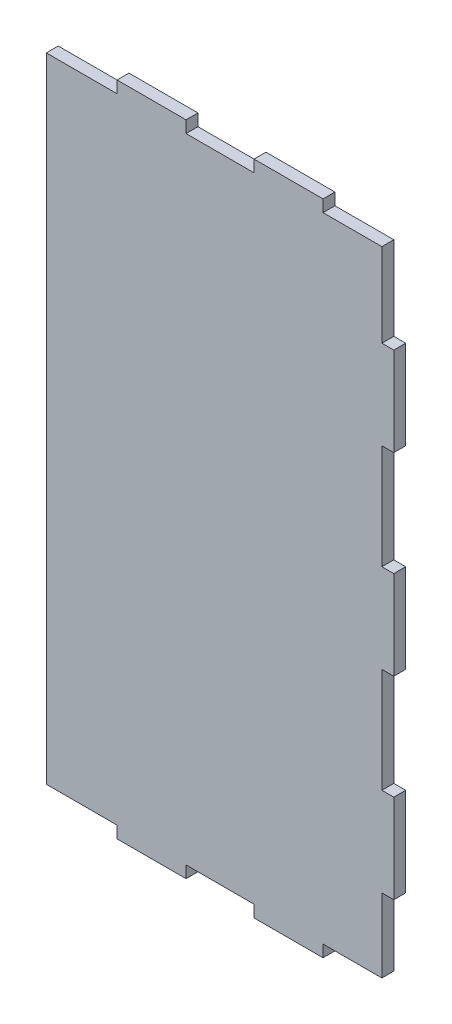
ISO-10303-21;
HEADER;
FILE_DESCRIPTION(('STEP AP214'),'2;1');
FILE_NAME('part.step','',(''),(''),'','','');
FILE_SCHEMA(('AUTOMOTIVE_DESIGN { 1 0 10303 214 1 1 1 1 }'));
ENDSEC;
DATA;
#1=APPLICATION_CONTEXT('core data for automotive mechanical design processes');
#2=APPLICATION_PROTOCOL_DEFINITION('international standard','automotive_design',2000,#1);
#3=PRODUCT_CONTEXT('',#1,'mechanical');
#4=PRODUCT('Part','Part','',(#3));
#5=PRODUCT_RELATED_PRODUCT_CATEGORY('part','',(#4));
#6=PRODUCT_DEFINITION_FORMATION('','',#4);
#7=PRODUCT_DEFINITION_CONTEXT('part definition',#1,'design');
#8=PRODUCT_DEFINITION('design','',#6,#7);
#9=PRODUCT_DEFINITION_SHAPE('','',#8);
#10=(LENGTH_UNIT() NAMED_UNIT(*) SI_UNIT(.MILLI.,.METRE.));
#11=(NAMED_UNIT(*) PLANE_ANGLE_UNIT() SI_UNIT($,.RADIAN.));
#12=(NAMED_UNIT(*) SI_UNIT($,.STERADIAN.) SOLID_ANGLE_UNIT());
#13=UNCERTAINTY_MEASURE_WITH_UNIT(LENGTH_MEASURE(1.E-05),#10,'distance_accuracy_value','');
#14=(GEOMETRIC_REPRESENTATION_CONTEXT(3) GLOBAL_UNCERTAINTY_ASSIGNED_CONTEXT((#13)) GLOBAL_UNIT_ASSIGNED_CONTEXT((#10,
#11,#12)) REPRESENTATION_CONTEXT('',''));
#15=CARTESIAN_POINT('',(0.,0.,0.));
#16=DIRECTION('',(0.,0.,1.));
#17=DIRECTION('',(1.,0.,0.));
#18=AXIS2_PLACEMENT_3D('',#15,#16,#17);
#19=CARTESIAN_POINT('',(350.,2.17082714312181E-13,12.));
#20=DIRECTION('',(-1.,0.,0.));
#21=DIRECTION('',(0.,-1.,0.));
#22=AXIS2_PLACEMENT_3D('',#19,#20,#21);
#23=PLANE('',#22);
#24=DIRECTION('',(0.,1.,0.));
#25=VECTOR('',#24,1.);
#26=CARTESIAN_POINT('',(350.,2.17082714312181E-13,0.));
#27=LINE('',#26,#25);
#28=CARTESIAN_POINT('',(350.,-380.75,0.));
#29=VERTEX_POINT('',#28);
#30=CARTESIAN_POINT('',(350.,-291.25,0.));
#31=VERTEX_POINT('',#30);
#32=EDGE_CURVE('E284',#29,#31,#27,.T.);
#33=ORIENTED_EDGE('',*,*,#32,.T.);
#34=DIRECTION('',(0.,0.,-1.));
#35=VECTOR('',#34,1.);
#36=CARTESIAN_POINT('',(350.,-291.25,12.));
#37=LINE('',#36,#35);
#38=CARTESIAN_POINT('',(350.,-291.25,12.));
#39=VERTEX_POINT('',#38);
#40=EDGE_CURVE('E11',#39,#31,#37,.T.);
#41=ORIENTED_EDGE('',*,*,#40,.F.);
#42=DIRECTION('',(0.,1.,0.));
#43=VECTOR('',#42,1.);
#44=CARTESIAN_POINT('',(350.,2.17082714312181E-13,12.));
#45=LINE('',#44,#43);
#46=CARTESIAN_POINT('',(350.,-380.75,12.));
#47=VERTEX_POINT('',#46);
#48=EDGE_CURVE('E166',#47,#39,#45,.T.);
#49=ORIENTED_EDGE('',*,*,#48,.F.);
#50=DIRECTION('',(0.,0.,-1.));
#51=VECTOR('',#50,1.);
#52=CARTESIAN_POINT('',(350.,-380.75,12.));
#53=LINE('',#52,#51);
#54=EDGE_CURVE('E280',#47,#29,#53,.T.);
#55=ORIENTED_EDGE('',*,*,#54,.T.);
#56=EDGE_LOOP('',(#33,#41,#49,#55));
#57=FACE_BOUND('',#56,.T.);
#58=ADVANCED_FACE('F41',(#57),#23,.F.);
#59=CARTESIAN_POINT('',(0.,-291.25,12.));
#60=DIRECTION('',(0.,1.,0.));
#61=DIRECTION('',(0.,0.,1.));
#62=AXIS2_PLACEMENT_3D('',#59,#60,#61);
#63=PLANE('',#62);
#64=DIRECTION('',(1.,0.,0.));
#65=VECTOR('',#64,1.);
#66=CARTESIAN_POINT('',(0.,-291.25,0.));
#67=LINE('',#66,#65);
#68=CARTESIAN_POINT('',(338.,-291.25,0.));
#69=VERTEX_POINT('',#68);
#70=EDGE_CURVE('E288',#69,#31,#67,.T.);
#71=ORIENTED_EDGE('',*,*,#70,.F.);
#72=DIRECTION('',(0.,0.,-1.));
#73=VECTOR('',#72,1.);
#74=CARTESIAN_POINT('',(338.,-291.25,12.));
#75=LINE('',#74,#73);
#76=CARTESIAN_POINT('',(338.,-291.25,12.));
#77=VERTEX_POINT('',#76);
#78=EDGE_CURVE('E50',#77,#69,#75,.T.);
#79=ORIENTED_EDGE('',*,*,#78,.F.);
#80=DIRECTION('',(1.,0.,0.));
#81=VECTOR('',#80,1.);
#82=CARTESIAN_POINT('',(0.,-291.25,12.));
#83=LINE('',#82,#81);
#84=EDGE_CURVE('E514',#77,#39,#83,.T.);
#85=ORIENTED_EDGE('',*,*,#84,.T.);
#86=ORIENTED_EDGE('',*,*,#40,.T.);
#87=EDGE_LOOP('',(#71,#79,#85,#86));
#88=FACE_BOUND('',#87,.T.);
#89=ADVANCED_FACE('F500',(#88),#63,.T.);
#90=CARTESIAN_POINT('',(338.,1.77846152759859E-13,12.));
#91=DIRECTION('',(1.,0.,0.));
#92=DIRECTION('',(0.,1.,0.));
#93=AXIS2_PLACEMENT_3D('',#90,#91,#92);
#94=PLANE('',#93);
#95=DIRECTION('',(0.,-1.,0.));
#96=VECTOR('',#95,1.);
#97=CARTESIAN_POINT('',(338.,1.77846152759859E-13,0.));
#98=LINE('',#97,#96);
#99=CARTESIAN_POINT('',(338.,-185.75,0.));
#100=VERTEX_POINT('',#99);
#101=EDGE_CURVE('E292',#100,#69,#98,.T.);
#102=ORIENTED_EDGE('',*,*,#101,.F.);
#103=DIRECTION('',(0.,0.,-1.));
#104=VECTOR('',#103,1.);
#105=CARTESIAN_POINT('',(338.,-185.75,12.));
#106=LINE('',#105,#104);
#107=CARTESIAN_POINT('',(338.,-185.75,12.));
#108=VERTEX_POINT('',#107);
#109=EDGE_CURVE('E488',#108,#100,#106,.T.);
#110=ORIENTED_EDGE('',*,*,#109,.F.);
#111=DIRECTION('',(0.,-1.,0.));
#112=VECTOR('',#111,1.);
#113=CARTESIAN_POINT('',(338.,1.77846152759859E-13,12.));
#114=LINE('',#113,#112);
#115=EDGE_CURVE('E497',#108,#77,#114,.T.);
#116=ORIENTED_EDGE('',*,*,#115,.T.);
#117=ORIENTED_EDGE('',*,*,#78,.T.);
#118=EDGE_LOOP('',(#102,#110,#116,#117));
#119=FACE_BOUND('',#118,.T.);
#120=ADVANCED_FACE('F495',(#119),#94,.T.);
#121=CARTESIAN_POINT('',(4.29633180883589E-13,-185.750000000001,12.));
#122=DIRECTION('',(0.,-1.,0.));
#123=DIRECTION('',(1.,0.,0.));
#124=AXIS2_PLACEMENT_3D('',#121,#122,#123);
#125=PLANE('',#124);
#126=DIRECTION('',(-1.,0.,0.));
#127=VECTOR('',#126,1.);
#128=CARTESIAN_POINT('',(4.29633180883589E-13,-185.750000000001,0.));
#129=LINE('',#128,#127);
#130=CARTESIAN_POINT('',(350.,-185.75,0.));
#131=VERTEX_POINT('',#130);
#132=EDGE_CURVE('E296',#131,#100,#129,.T.);
#133=ORIENTED_EDGE('',*,*,#132,.F.);
#134=DIRECTION('',(0.,0.,-1.));
#135=VECTOR('',#134,1.);
#136=CARTESIAN_POINT('',(350.,-185.75,12.));
#137=LINE('',#136,#135);
#138=CARTESIAN_POINT('',(350.,-185.75,12.));
#139=VERTEX_POINT('',#138);
#140=EDGE_CURVE('E485',#139,#131,#137,.T.);
#141=ORIENTED_EDGE('',*,*,#140,.F.);
#142=DIRECTION('',(-1.,0.,0.));
#143=VECTOR('',#142,1.);
#144=CARTESIAN_POINT('',(4.29633180883589E-13,-185.750000000001,12.));
#145=LINE('',#144,#143);
#146=EDGE_CURVE('E511',#139,#108,#145,.T.);
#147=ORIENTED_EDGE('',*,*,#146,.T.);
#148=ORIENTED_EDGE('',*,*,#109,.T.);
#149=EDGE_LOOP('',(#133,#141,#147,#148));
#150=FACE_BOUND('',#149,.T.);
#151=ADVANCED_FACE('F508',(#150),#125,.T.);
#152=CARTESIAN_POINT('',(350.,0.,12.));
#153=DIRECTION('',(1.,0.,0.));
#154=DIRECTION('',(0.,0.,-1.));
#155=AXIS2_PLACEMENT_3D('',#152,#153,#154);
#156=PLANE('',#155);
#157=DIRECTION('',(0.,-1.,0.));
#158=VECTOR('',#157,1.);
#159=CARTESIAN_POINT('',(350.,0.,0.));
#160=LINE('',#159,#158);
#161=CARTESIAN_POINT('',(350.,-96.25,0.));
#162=VERTEX_POINT('',#161);
#163=EDGE_CURVE('E300',#162,#131,#160,.T.);
#164=ORIENTED_EDGE('',*,*,#163,.F.);
#165=DIRECTION('',(0.,0.,-1.));
#166=VECTOR('',#165,1.);
#167=CARTESIAN_POINT('',(350.,-96.25,12.));
#168=LINE('',#167,#166);
#169=CARTESIAN_POINT('',(350.,-96.25,12.));
#170=VERTEX_POINT('',#169);
#171=EDGE_CURVE('E482',#170,#162,#168,.T.);
#172=ORIENTED_EDGE('',*,*,#171,.F.);
#173=DIRECTION('',(0.,-1.,0.));
#174=VECTOR('',#173,1.);
#175=CARTESIAN_POINT('',(350.,0.,12.));
#176=LINE('',#175,#174);
#177=EDGE_CURVE('E519',#170,#139,#176,.T.);
#178=ORIENTED_EDGE('',*,*,#177,.T.);
#179=ORIENTED_EDGE('',*,*,#140,.T.);
#180=EDGE_LOOP('',(#164,#172,#178,#179));
#181=FACE_BOUND('',#180,.T.);
#182=ADVANCED_FACE('F632',(#181),#156,.T.);
#183=CARTESIAN_POINT('',(0.,-96.25,12.));
#184=DIRECTION('',(0.,-1.,0.));
#185=DIRECTION('',(0.,0.,-1.));
#186=AXIS2_PLACEMENT_3D('',#183,#184,#185);
#187=PLANE('',#186);
#188=DIRECTION('',(-1.,0.,0.));
#189=VECTOR('',#188,1.);
#190=CARTESIAN_POINT('',(0.,-96.25,0.));
#191=LINE('',#190,#189);
#192=CARTESIAN_POINT('',(338.,-96.25,0.));
#193=VERTEX_POINT('',#192);
#194=EDGE_CURVE('E304',#162,#193,#191,.T.);
#195=ORIENTED_EDGE('',*,*,#194,.T.);
#196=DIRECTION('',(0.,0.,-1.));
#197=VECTOR('',#196,1.);
#198=CARTESIAN_POINT('',(338.,-96.25,12.));
#199=LINE('',#198,#197);
#200=CARTESIAN_POINT('',(338.,-96.25,12.));
#201=VERTEX_POINT('',#200);
#202=EDGE_CURVE('E478',#201,#193,#199,.T.);
#203=ORIENTED_EDGE('',*,*,#202,.F.);
#204=DIRECTION('',(-1.,0.,0.));
#205=VECTOR('',#204,1.);
#206=CARTESIAN_POINT('',(0.,-96.25,12.));
#207=LINE('',#206,#205);
#208=EDGE_CURVE('E526',#170,#201,#207,.T.);
#209=ORIENTED_EDGE('',*,*,#208,.F.);
#210=ORIENTED_EDGE('',*,*,#171,.T.);
#211=EDGE_LOOP('',(#195,#203,#209,#210));
#212=FACE_BOUND('',#211,.T.);
#213=ADVANCED_FACE('F635',(#212),#187,.F.);
#214=CARTESIAN_POINT('',(338.,-1.78162792794447E-12,12.));
#215=DIRECTION('',(-1.,0.,0.));
#216=DIRECTION('',(0.,-1.,0.));
#217=AXIS2_PLACEMENT_3D('',#214,#215,#216);
#218=PLANE('',#217);
#219=DIRECTION('',(0.,1.,0.));
#220=VECTOR('',#219,1.);
#221=CARTESIAN_POINT('',(338.,-1.78162792794447E-12,0.));
#222=LINE('',#221,#220);
#223=CARTESIAN_POINT('',(338.,-12.,0.));
#224=VERTEX_POINT('',#223);
#225=EDGE_CURVE('E307',#193,#224,#222,.T.);
#226=ORIENTED_EDGE('',*,*,#225,.T.);
#227=DIRECTION('',(0.,0.,-1.));
#228=VECTOR('',#227,1.);
#229=CARTESIAN_POINT('',(338.,-12.,12.));
#230=LINE('',#229,#228);
#231=CARTESIAN_POINT('',(338.,-12.,12.));
#232=VERTEX_POINT('',#231);
#233=EDGE_CURVE('E475',#232,#224,#230,.T.);
#234=ORIENTED_EDGE('',*,*,#233,.F.);
#235=DIRECTION('',(0.,1.,0.));
#236=VECTOR('',#235,1.);
#237=CARTESIAN_POINT('',(338.,-1.78162792794447E-12,12.));
#238=LINE('',#237,#236);
#239=EDGE_CURVE('E529',#201,#232,#238,.T.);
#240=ORIENTED_EDGE('',*,*,#239,.F.);
#241=ORIENTED_EDGE('',*,*,#202,.T.);
#242=EDGE_LOOP('',(#226,#234,#240,#241));
#243=FACE_BOUND('',#242,.T.);
#244=ADVANCED_FACE('F639',(#243),#218,.F.);
#245=CARTESIAN_POINT('',(0.,-12.,12.));
#246=DIRECTION('',(0.,1.,0.));
#247=DIRECTION('',(-1.,0.,0.));
#248=AXIS2_PLACEMENT_3D('',#245,#246,#247);
#249=PLANE('',#248);
#250=DIRECTION('',(1.,0.,0.));
#251=VECTOR('',#250,1.);
#252=CARTESIAN_POINT('',(0.,-12.,0.));
#253=LINE('',#252,#251);
#254=CARTESIAN_POINT('',(278.75,-12.,0.));
#255=VERTEX_POINT('',#254);
#256=EDGE_CURVE('E311',#255,#224,#253,.T.);
#257=ORIENTED_EDGE('',*,*,#256,.F.);
#258=DIRECTION('',(0.,0.,-1.));
#259=VECTOR('',#258,1.);
#260=CARTESIAN_POINT('',(278.75,-12.,12.));
#261=LINE('',#260,#259);
#262=CARTESIAN_POINT('',(278.75,-12.,12.));
#263=VERTEX_POINT('',#262);
#264=EDGE_CURVE('E472',#263,#255,#261,.T.);
#265=ORIENTED_EDGE('',*,*,#264,.F.);
#266=DIRECTION('',(1.,0.,0.));
#267=VECTOR('',#266,1.);
#268=CARTESIAN_POINT('',(0.,-12.,12.));
#269=LINE('',#268,#267);
#270=EDGE_CURVE('E532',#263,#232,#269,.T.);
#271=ORIENTED_EDGE('',*,*,#270,.T.);
#272=ORIENTED_EDGE('',*,*,#233,.T.);
#273=EDGE_LOOP('',(#257,#265,#271,#272));
#274=FACE_BOUND('',#273,.T.);
#275=ADVANCED_FACE('F643',(#274),#249,.T.);
#276=CARTESIAN_POINT('',(278.75,0.,12.));
#277=DIRECTION('',(1.,0.,0.));
#278=DIRECTION('',(0.,0.,-1.));
#279=AXIS2_PLACEMENT_3D('',#276,#277,#278);
#280=PLANE('',#279);
#281=DIRECTION('',(0.,-1.,0.));
#282=VECTOR('',#281,1.);
#283=CARTESIAN_POINT('',(278.75,0.,0.));
#284=LINE('',#283,#282);
#285=CARTESIAN_POINT('',(278.75,-4.45287292250738E-13,0.));
#286=VERTEX_POINT('',#285);
#287=EDGE_CURVE('E315',#286,#255,#284,.T.);
#288=ORIENTED_EDGE('',*,*,#287,.F.);
#289=DIRECTION('',(0.,0.,-1.));
#290=VECTOR('',#289,1.);
#291=CARTESIAN_POINT('',(278.75,-4.45287292250738E-13,12.));
#292=LINE('',#291,#290);
#293=CARTESIAN_POINT('',(278.75,-4.45287292250738E-13,12.));
#294=VERTEX_POINT('',#293);
#295=EDGE_CURVE('E469',#294,#286,#292,.T.);
#296=ORIENTED_EDGE('',*,*,#295,.F.);
#297=DIRECTION('',(0.,-1.,0.));
#298=VECTOR('',#297,1.);
#299=CARTESIAN_POINT('',(278.75,0.,12.));
#300=LINE('',#299,#298);
#301=EDGE_CURVE('E536',#294,#263,#300,.T.);
#302=ORIENTED_EDGE('',*,*,#301,.T.);
#303=ORIENTED_EDGE('',*,*,#264,.T.);
#304=EDGE_LOOP('',(#288,#296,#302,#303));
#305=FACE_BOUND('',#304,.T.);
#306=ADVANCED_FACE('F647',(#305),#280,.T.);
#307=CARTESIAN_POINT('',(0.,0.,12.));
#308=DIRECTION('',(0.,1.,0.));
#309=DIRECTION('',(-1.,0.,0.));
#310=AXIS2_PLACEMENT_3D('',#307,#308,#309);
#311=PLANE('',#310);
#312=DIRECTION('',(1.,0.,0.));
#313=VECTOR('',#312,1.);
#314=CARTESIAN_POINT('',(0.,0.,0.));
#315=LINE('',#314,#313);
#316=CARTESIAN_POINT('',(209.25,-3.34264989788222E-13,0.));
#317=VERTEX_POINT('',#316);
#318=EDGE_CURVE('E319',#317,#286,#315,.T.);
#319=ORIENTED_EDGE('',*,*,#318,.F.);
#320=DIRECTION('',(0.,0.,-1.));
#321=VECTOR('',#320,1.);
#322=CARTESIAN_POINT('',(209.25,-3.34264989788222E-13,12.));
#323=LINE('',#322,#321);
#324=CARTESIAN_POINT('',(209.25,-3.34264989788222E-13,12.));
#325=VERTEX_POINT('',#324);
#326=EDGE_CURVE('E466',#325,#317,#323,.T.);
#327=ORIENTED_EDGE('',*,*,#326,.F.);
#328=DIRECTION('',(1.,0.,0.));
#329=VECTOR('',#328,1.);
#330=CARTESIAN_POINT('',(0.,0.,12.));
#331=LINE('',#330,#329);
#332=EDGE_CURVE('E540',#325,#294,#331,.T.);
#333=ORIENTED_EDGE('',*,*,#332,.T.);
#334=ORIENTED_EDGE('',*,*,#295,.T.);
#335=EDGE_LOOP('',(#319,#327,#333,#334));
#336=FACE_BOUND('',#335,.T.);
#337=ADVANCED_FACE('F651',(#336),#311,.T.);
#338=CARTESIAN_POINT('',(209.25,0.,12.));
#339=DIRECTION('',(1.,0.,0.));
#340=DIRECTION('',(0.,0.,-1.));
#341=AXIS2_PLACEMENT_3D('',#338,#339,#340);
#342=PLANE('',#341);
#343=DIRECTION('',(0.,-1.,0.));
#344=VECTOR('',#343,1.);
#345=CARTESIAN_POINT('',(209.25,0.,0.));
#346=LINE('',#345,#344);
#347=CARTESIAN_POINT('',(209.25,-11.9999999999999,0.));
#348=VERTEX_POINT('',#347);
#349=EDGE_CURVE('E323',#317,#348,#346,.T.);
#350=ORIENTED_EDGE('',*,*,#349,.T.);
#351=DIRECTION('',(0.,0.,-1.));
#352=VECTOR('',#351,1.);
#353=CARTESIAN_POINT('',(209.25,-11.9999999999999,12.));
#354=LINE('',#353,#352);
#355=CARTESIAN_POINT('',(209.25,-11.9999999999999,12.));
#356=VERTEX_POINT('',#355);
#357=EDGE_CURVE('E463',#356,#348,#354,.T.);
#358=ORIENTED_EDGE('',*,*,#357,.F.);
#359=DIRECTION('',(0.,-1.,0.));
#360=VECTOR('',#359,1.);
#361=CARTESIAN_POINT('',(209.25,0.,12.));
#362=LINE('',#361,#360);
#363=EDGE_CURVE('E544',#325,#356,#362,.T.);
#364=ORIENTED_EDGE('',*,*,#363,.F.);
#365=ORIENTED_EDGE('',*,*,#326,.T.);
#366=EDGE_LOOP('',(#350,#358,#364,#365));
#367=FACE_BOUND('',#366,.T.);
#368=ADVANCED_FACE('F655',(#367),#342,.F.);
#369=CARTESIAN_POINT('',(0.,-11.9999999999999,12.));
#370=DIRECTION('',(0.,1.,0.));
#371=DIRECTION('',(0.,0.,1.));
#372=AXIS2_PLACEMENT_3D('',#369,#370,#371);
#373=PLANE('',#372);
#374=DIRECTION('',(1.,0.,0.));
#375=VECTOR('',#374,1.);
#376=CARTESIAN_POINT('',(0.,-11.9999999999999,0.));
#377=LINE('',#376,#375);
#378=CARTESIAN_POINT('',(140.75,-11.9999999999999,0.));
#379=VERTEX_POINT('',#378);
#380=EDGE_CURVE('E327',#379,#348,#377,.T.);
#381=ORIENTED_EDGE('',*,*,#380,.F.);
#382=DIRECTION('',(0.,0.,-1.));
#383=VECTOR('',#382,1.);
#384=CARTESIAN_POINT('',(140.75,-11.9999999999999,12.));
#385=LINE('',#384,#383);
#386=CARTESIAN_POINT('',(140.75,-11.9999999999999,12.));
#387=VERTEX_POINT('',#386);
#388=EDGE_CURVE('E460',#387,#379,#385,.T.);
#389=ORIENTED_EDGE('',*,*,#388,.F.);
#390=DIRECTION('',(1.,0.,0.));
#391=VECTOR('',#390,1.);
#392=CARTESIAN_POINT('',(0.,-11.9999999999999,12.));
#393=LINE('',#392,#391);
#394=EDGE_CURVE('E547',#387,#356,#393,.T.);
#395=ORIENTED_EDGE('',*,*,#394,.T.);
#396=ORIENTED_EDGE('',*,*,#357,.T.);
#397=EDGE_LOOP('',(#381,#389,#395,#396));
#398=FACE_BOUND('',#397,.T.);
#399=ADVANCED_FACE('F659',(#398),#373,.T.);
#400=CARTESIAN_POINT('',(140.75,0.,12.));
#401=DIRECTION('',(1.,0.,0.));
#402=DIRECTION('',(0.,0.,-1.));
#403=AXIS2_PLACEMENT_3D('',#400,#401,#402);
#404=PLANE('',#403);
#405=DIRECTION('',(0.,-1.,0.));
#406=VECTOR('',#405,1.);
#407=CARTESIAN_POINT('',(140.75,0.,0.));
#408=LINE('',#407,#406);
#409=CARTESIAN_POINT('',(140.75,2.24840130526605E-13,0.));
#410=VERTEX_POINT('',#409);
#411=EDGE_CURVE('E331',#410,#379,#408,.T.);
#412=ORIENTED_EDGE('',*,*,#411,.F.);
#413=DIRECTION('',(0.,0.,-1.));
#414=VECTOR('',#413,1.);
#415=CARTESIAN_POINT('',(140.75,2.24840130526605E-13,12.));
#416=LINE('',#415,#414);
#417=CARTESIAN_POINT('',(140.75,2.24840130526605E-13,12.));
#418=VERTEX_POINT('',#417);
#419=EDGE_CURVE('E457',#418,#410,#416,.T.);
#420=ORIENTED_EDGE('',*,*,#419,.F.);
#421=DIRECTION('',(0.,-1.,0.));
#422=VECTOR('',#421,1.);
#423=CARTESIAN_POINT('',(140.75,0.,12.));
#424=LINE('',#423,#422);
#425=EDGE_CURVE('E551',#418,#387,#424,.T.);
#426=ORIENTED_EDGE('',*,*,#425,.T.);
#427=ORIENTED_EDGE('',*,*,#388,.T.);
#428=EDGE_LOOP('',(#412,#420,#426,#427));
#429=FACE_BOUND('',#428,.T.);
#430=ADVANCED_FACE('F663',(#429),#404,.T.);
#431=CARTESIAN_POINT('',(0.,0.,12.));
#432=DIRECTION('',(0.,1.,0.));
#433=DIRECTION('',(-1.,0.,0.));
#434=AXIS2_PLACEMENT_3D('',#431,#432,#433);
#435=PLANE('',#434);
#436=DIRECTION('',(1.,0.,0.));
#437=VECTOR('',#436,1.);
#438=CARTESIAN_POINT('',(0.,0.,0.));
#439=LINE('',#438,#437);
#440=CARTESIAN_POINT('',(71.25,1.1381782806409E-13,0.));
#441=VERTEX_POINT('',#440);
#442=EDGE_CURVE('E335',#441,#410,#439,.T.);
#443=ORIENTED_EDGE('',*,*,#442,.F.);
#444=DIRECTION('',(0.,0.,-1.));
#445=VECTOR('',#444,1.);
#446=CARTESIAN_POINT('',(71.25,1.1381782806409E-13,12.));
#447=LINE('',#446,#445);
#448=CARTESIAN_POINT('',(71.25,1.1381782806409E-13,12.));
#449=VERTEX_POINT('',#448);
#450=EDGE_CURVE('E454',#449,#441,#447,.T.);
#451=ORIENTED_EDGE('',*,*,#450,.F.);
#452=DIRECTION('',(1.,0.,0.));
#453=VECTOR('',#452,1.);
#454=CARTESIAN_POINT('',(0.,0.,12.));
#455=LINE('',#454,#453);
#456=EDGE_CURVE('E555',#449,#418,#455,.T.);
#457=ORIENTED_EDGE('',*,*,#456,.T.);
#458=ORIENTED_EDGE('',*,*,#419,.T.);
#459=EDGE_LOOP('',(#443,#451,#457,#458));
#460=FACE_BOUND('',#459,.T.);
#461=ADVANCED_FACE('F667',(#460),#435,.T.);
#462=CARTESIAN_POINT('',(71.25,0.,12.));
#463=DIRECTION('',(1.,0.,0.));
#464=DIRECTION('',(0.,0.,-1.));
#465=AXIS2_PLACEMENT_3D('',#462,#463,#464);
#466=PLANE('',#465);
#467=DIRECTION('',(0.,-1.,0.));
#468=VECTOR('',#467,1.);
#469=CARTESIAN_POINT('',(71.25,0.,0.));
#470=LINE('',#469,#468);
#471=CARTESIAN_POINT('',(71.25,-12.,0.));
#472=VERTEX_POINT('',#471);
#473=EDGE_CURVE('E339',#441,#472,#470,.T.);
#474=ORIENTED_EDGE('',*,*,#473,.T.);
#475=DIRECTION('',(0.,0.,-1.));
#476=VECTOR('',#475,1.);
#477=CARTESIAN_POINT('',(71.25,-12.,12.));
#478=LINE('',#477,#476);
#479=CARTESIAN_POINT('',(71.25,-12.,12.));
#480=VERTEX_POINT('',#479);
#481=EDGE_CURVE('E450',#480,#472,#478,.T.);
#482=ORIENTED_EDGE('',*,*,#481,.F.);
#483=DIRECTION('',(0.,-1.,0.));
#484=VECTOR('',#483,1.);
#485=CARTESIAN_POINT('',(71.25,0.,12.));
#486=LINE('',#485,#484);
#487=EDGE_CURVE('E559',#449,#480,#486,.T.);
#488=ORIENTED_EDGE('',*,*,#487,.F.);
#489=ORIENTED_EDGE('',*,*,#450,.T.);
#490=EDGE_LOOP('',(#474,#482,#488,#489));
#491=FACE_BOUND('',#490,.T.);
#492=ADVANCED_FACE('F671',(#491),#466,.F.);
#493=CARTESIAN_POINT('',(0.,-12.,12.));
#494=DIRECTION('',(0.,-1.,0.));
#495=DIRECTION('',(0.,0.,-1.));
#496=AXIS2_PLACEMENT_3D('',#493,#494,#495);
#497=PLANE('',#496);
#498=DIRECTION('',(-1.,0.,0.));
#499=VECTOR('',#498,1.);
#500=CARTESIAN_POINT('',(0.,-12.,0.));
#501=LINE('',#500,#499);
#502=CARTESIAN_POINT('',(0.,-12.,0.));
#503=VERTEX_POINT('',#502);
#504=EDGE_CURVE('E342',#472,#503,#501,.T.);
#505=ORIENTED_EDGE('',*,*,#504,.T.);
#506=DIRECTION('',(0.,0.,-1.));
#507=VECTOR('',#506,1.);
#508=CARTESIAN_POINT('',(0.,-12.,12.));
#509=LINE('',#508,#507);
#510=CARTESIAN_POINT('',(0.,-12.,12.));
#511=VERTEX_POINT('',#510);
#512=EDGE_CURVE('E446',#511,#503,#509,.T.);
#513=ORIENTED_EDGE('',*,*,#512,.F.);
#514=DIRECTION('',(-1.,0.,0.));
#515=VECTOR('',#514,1.);
#516=CARTESIAN_POINT('',(0.,-12.,12.));
#517=LINE('',#516,#515);
#518=EDGE_CURVE('E562',#480,#511,#517,.T.);
#519=ORIENTED_EDGE('',*,*,#518,.F.);
#520=ORIENTED_EDGE('',*,*,#481,.T.);
#521=EDGE_LOOP('',(#505,#513,#519,#520));
#522=FACE_BOUND('',#521,.T.);
#523=ADVANCED_FACE('F675',(#522),#497,.F.);
#524=CARTESIAN_POINT('',(0.,0.,12.));
#525=DIRECTION('',(1.,0.,0.));
#526=DIRECTION('',(0.,0.,-1.));
#527=AXIS2_PLACEMENT_3D('',#524,#525,#526);
#528=PLANE('',#527);
#529=DIRECTION('',(0.,-1.,0.));
#530=VECTOR('',#529,1.);
#531=CARTESIAN_POINT('',(0.,0.,0.));
#532=LINE('',#531,#530);
#533=CARTESIAN_POINT('',(0.,-650.,0.));
#534=VERTEX_POINT('',#533);
#535=EDGE_CURVE('E345',#503,#534,#532,.T.);
#536=ORIENTED_EDGE('',*,*,#535,.T.);
#537=DIRECTION('',(0.,0.,-1.));
#538=VECTOR('',#537,1.);
#539=CARTESIAN_POINT('',(0.,-650.,12.));
#540=LINE('',#539,#538);
#541=CARTESIAN_POINT('',(0.,-650.,12.));
#542=VERTEX_POINT('',#541);
#543=EDGE_CURVE('E443',#542,#534,#540,.T.);
#544=ORIENTED_EDGE('',*,*,#543,.F.);
#545=DIRECTION('',(0.,-1.,0.));
#546=VECTOR('',#545,1.);
#547=CARTESIAN_POINT('',(0.,0.,12.));
#548=LINE('',#547,#546);
#549=EDGE_CURVE('E565',#511,#542,#548,.T.);
#550=ORIENTED_EDGE('',*,*,#549,.F.);
#551=ORIENTED_EDGE('',*,*,#512,.T.);
#552=EDGE_LOOP('',(#536,#544,#550,#551));
#553=FACE_BOUND('',#552,.T.);
#554=ADVANCED_FACE('F679',(#553),#528,.F.);
#555=CARTESIAN_POINT('',(0.,-650.,12.));
#556=DIRECTION('',(0.,-1.,0.));
#557=DIRECTION('',(0.,0.,-1.));
#558=AXIS2_PLACEMENT_3D('',#555,#556,#557);
#559=PLANE('',#558);
#560=DIRECTION('',(-1.,0.,0.));
#561=VECTOR('',#560,1.);
#562=CARTESIAN_POINT('',(0.,-650.,0.));
#563=LINE('',#562,#561);
#564=CARTESIAN_POINT('',(71.25,-650.,0.));
#565=VERTEX_POINT('',#564);
#566=EDGE_CURVE('E349',#565,#534,#563,.T.);
#567=ORIENTED_EDGE('',*,*,#566,.F.);
#568=DIRECTION('',(0.,0.,-1.));
#569=VECTOR('',#568,1.);
#570=CARTESIAN_POINT('',(71.25,-650.,12.));
#571=LINE('',#570,#569);
#572=CARTESIAN_POINT('',(71.25,-650.,12.));
#573=VERTEX_POINT('',#572);
#574=EDGE_CURVE('E440',#573,#565,#571,.T.);
#575=ORIENTED_EDGE('',*,*,#574,.F.);
#576=DIRECTION('',(-1.,0.,0.));
#577=VECTOR('',#576,1.);
#578=CARTESIAN_POINT('',(0.,-650.,12.));
#579=LINE('',#578,#577);
#580=EDGE_CURVE('E568',#573,#542,#579,.T.);
#581=ORIENTED_EDGE('',*,*,#580,.T.);
#582=ORIENTED_EDGE('',*,*,#543,.T.);
#583=EDGE_LOOP('',(#567,#575,#581,#582));
#584=FACE_BOUND('',#583,.T.);
#585=ADVANCED_FACE('F683',(#584),#559,.T.);
#586=CARTESIAN_POINT('',(71.25,0.,12.));
#587=DIRECTION('',(-1.,0.,0.));
#588=DIRECTION('',(0.,0.,1.));
#589=AXIS2_PLACEMENT_3D('',#586,#587,#588);
#590=PLANE('',#589);
#591=DIRECTION('',(0.,1.,0.));
#592=VECTOR('',#591,1.);
#593=CARTESIAN_POINT('',(71.25,0.,0.));
#594=LINE('',#593,#592);
#595=CARTESIAN_POINT('',(71.25,-662.,0.));
#596=VERTEX_POINT('',#595);
#597=EDGE_CURVE('E353',#596,#565,#594,.T.);
#598=ORIENTED_EDGE('',*,*,#597,.F.);
#599=DIRECTION('',(0.,0.,-1.));
#600=VECTOR('',#599,1.);
#601=CARTESIAN_POINT('',(71.25,-662.,12.));
#602=LINE('',#601,#600);
#603=CARTESIAN_POINT('',(71.25,-662.,12.));
#604=VERTEX_POINT('',#603);
#605=EDGE_CURVE('E437',#604,#596,#602,.T.);
#606=ORIENTED_EDGE('',*,*,#605,.F.);
#607=DIRECTION('',(0.,1.,0.));
#608=VECTOR('',#607,1.);
#609=CARTESIAN_POINT('',(71.25,0.,12.));
#610=LINE('',#609,#608);
#611=EDGE_CURVE('E572',#604,#573,#610,.T.);
#612=ORIENTED_EDGE('',*,*,#611,.T.);
#613=ORIENTED_EDGE('',*,*,#574,.T.);
#614=EDGE_LOOP('',(#598,#606,#612,#613));
#615=FACE_BOUND('',#614,.T.);
#616=ADVANCED_FACE('F687',(#615),#590,.T.);
#617=CARTESIAN_POINT('',(0.,-662.,12.));
#618=DIRECTION('',(0.,1.,0.));
#619=DIRECTION('',(0.,0.,1.));
#620=AXIS2_PLACEMENT_3D('',#617,#618,#619);
#621=PLANE('',#620);
#622=DIRECTION('',(1.,0.,0.));
#623=VECTOR('',#622,1.);
#624=CARTESIAN_POINT('',(0.,-662.,0.));
#625=LINE('',#624,#623);
#626=CARTESIAN_POINT('',(140.75,-662.,0.));
#627=VERTEX_POINT('',#626);
#628=EDGE_CURVE('E357',#596,#627,#625,.T.);
#629=ORIENTED_EDGE('',*,*,#628,.T.);
#630=DIRECTION('',(0.,0.,-1.));
#631=VECTOR('',#630,1.);
#632=CARTESIAN_POINT('',(140.75,-662.,12.));
#633=LINE('',#632,#631);
#634=CARTESIAN_POINT('',(140.75,-662.,12.));
#635=VERTEX_POINT('',#634);
#636=EDGE_CURVE('E433',#635,#627,#633,.T.);
#637=ORIENTED_EDGE('',*,*,#636,.F.);
#638=DIRECTION('',(1.,0.,0.));
#639=VECTOR('',#638,1.);
#640=CARTESIAN_POINT('',(0.,-662.,12.));
#641=LINE('',#640,#639);
#642=EDGE_CURVE('E576',#604,#635,#641,.T.);
#643=ORIENTED_EDGE('',*,*,#642,.F.);
#644=ORIENTED_EDGE('',*,*,#605,.T.);
#645=EDGE_LOOP('',(#629,#637,#643,#644));
#646=FACE_BOUND('',#645,.T.);
#647=ADVANCED_FACE('F691',(#646),#621,.F.);
#648=CARTESIAN_POINT('',(140.750000000005,-9.76649316974974E-13,12.));
#649=DIRECTION('',(-1.,0.,0.));
#650=DIRECTION('',(0.,-1.,0.));
#651=AXIS2_PLACEMENT_3D('',#648,#649,#650);
#652=PLANE('',#651);
#653=DIRECTION('',(0.,1.,0.));
#654=VECTOR('',#653,1.);
#655=CARTESIAN_POINT('',(140.750000000005,-9.76649316974974E-13,0.));
#656=LINE('',#655,#654);
#657=CARTESIAN_POINT('',(140.75,-650.,0.));
#658=VERTEX_POINT('',#657);
#659=EDGE_CURVE('E360',#627,#658,#656,.T.);
#660=ORIENTED_EDGE('',*,*,#659,.T.);
#661=DIRECTION('',(0.,0.,-1.));
#662=VECTOR('',#661,1.);
#663=CARTESIAN_POINT('',(140.75,-650.,12.));
#664=LINE('',#663,#662);
#665=CARTESIAN_POINT('',(140.75,-650.,12.));
#666=VERTEX_POINT('',#665);
#667=EDGE_CURVE('E429',#666,#658,#664,.T.);
#668=ORIENTED_EDGE('',*,*,#667,.F.);
#669=DIRECTION('',(0.,1.,0.));
#670=VECTOR('',#669,1.);
#671=CARTESIAN_POINT('',(140.750000000005,-9.76649316974974E-13,12.));
#672=LINE('',#671,#670);
#673=EDGE_CURVE('E579',#635,#666,#672,.T.);
#674=ORIENTED_EDGE('',*,*,#673,.F.);
#675=ORIENTED_EDGE('',*,*,#636,.T.);
#676=EDGE_LOOP('',(#660,#668,#674,#675));
#677=FACE_BOUND('',#676,.T.);
#678=ADVANCED_FACE('F695',(#677),#652,.F.);
#679=CARTESIAN_POINT('',(0.,-650.,12.));
#680=DIRECTION('',(0.,1.,0.));
#681=DIRECTION('',(0.,0.,1.));
#682=AXIS2_PLACEMENT_3D('',#679,#680,#681);
#683=PLANE('',#682);
#684=DIRECTION('',(1.,0.,0.));
#685=VECTOR('',#684,1.);
#686=CARTESIAN_POINT('',(0.,-650.,0.));
#687=LINE('',#686,#685);
#688=CARTESIAN_POINT('',(209.25,-650.,0.));
#689=VERTEX_POINT('',#688);
#690=EDGE_CURVE('E363',#658,#689,#687,.T.);
#691=ORIENTED_EDGE('',*,*,#690,.T.);
#692=DIRECTION('',(0.,0.,-1.));
#693=VECTOR('',#692,1.);
#694=CARTESIAN_POINT('',(209.25,-650.,12.));
#695=LINE('',#694,#693);
#696=CARTESIAN_POINT('',(209.25,-650.,12.));
#697=VERTEX_POINT('',#696);
#698=EDGE_CURVE('E426',#697,#689,#695,.T.);
#699=ORIENTED_EDGE('',*,*,#698,.F.);
#700=DIRECTION('',(1.,0.,0.));
#701=VECTOR('',#700,1.);
#702=CARTESIAN_POINT('',(0.,-650.,12.));
#703=LINE('',#702,#701);
#704=EDGE_CURVE('E582',#666,#697,#703,.T.);
#705=ORIENTED_EDGE('',*,*,#704,.F.);
#706=ORIENTED_EDGE('',*,*,#667,.T.);
#707=EDGE_LOOP('',(#691,#699,#705,#706));
#708=FACE_BOUND('',#707,.T.);
#709=ADVANCED_FACE('F699',(#708),#683,.F.);
#710=CARTESIAN_POINT('',(209.25,0.,12.));
#711=DIRECTION('',(-1.,0.,0.));
#712=DIRECTION('',(0.,0.,1.));
#713=AXIS2_PLACEMENT_3D('',#710,#711,#712);
#714=PLANE('',#713);
#715=DIRECTION('',(0.,1.,0.));
#716=VECTOR('',#715,1.);
#717=CARTESIAN_POINT('',(209.25,0.,0.));
#718=LINE('',#717,#716);
#719=CARTESIAN_POINT('',(209.25,-662.,0.));
#720=VERTEX_POINT('',#719);
#721=EDGE_CURVE('E367',#720,#689,#718,.T.);
#722=ORIENTED_EDGE('',*,*,#721,.F.);
#723=DIRECTION('',(0.,0.,-1.));
#724=VECTOR('',#723,1.);
#725=CARTESIAN_POINT('',(209.25,-662.,12.));
#726=LINE('',#725,#724);
#727=CARTESIAN_POINT('',(209.25,-662.,12.));
#728=VERTEX_POINT('',#727);
#729=EDGE_CURVE('E423',#728,#720,#726,.T.);
#730=ORIENTED_EDGE('',*,*,#729,.F.);
#731=DIRECTION('',(0.,1.,0.));
#732=VECTOR('',#731,1.);
#733=CARTESIAN_POINT('',(209.25,0.,12.));
#734=LINE('',#733,#732);
#735=EDGE_CURVE('E585',#728,#697,#734,.T.);
#736=ORIENTED_EDGE('',*,*,#735,.T.);
#737=ORIENTED_EDGE('',*,*,#698,.T.);
#738=EDGE_LOOP('',(#722,#730,#736,#737));
#739=FACE_BOUND('',#738,.T.);
#740=ADVANCED_FACE('F703',(#739),#714,.T.);
#741=CARTESIAN_POINT('',(0.,-662.,12.));
#742=DIRECTION('',(0.,1.,0.));
#743=DIRECTION('',(0.,0.,1.));
#744=AXIS2_PLACEMENT_3D('',#741,#742,#743);
#745=PLANE('',#744);
#746=DIRECTION('',(1.,0.,0.));
#747=VECTOR('',#746,1.);
#748=CARTESIAN_POINT('',(0.,-662.,0.));
#749=LINE('',#748,#747);
#750=CARTESIAN_POINT('',(278.75,-662.,0.));
#751=VERTEX_POINT('',#750);
#752=EDGE_CURVE('E371',#720,#751,#749,.T.);
#753=ORIENTED_EDGE('',*,*,#752,.T.);
#754=DIRECTION('',(0.,0.,-1.));
#755=VECTOR('',#754,1.);
#756=CARTESIAN_POINT('',(278.75,-662.,12.));
#757=LINE('',#756,#755);
#758=CARTESIAN_POINT('',(278.75,-662.,12.));
#759=VERTEX_POINT('',#758);
#760=EDGE_CURVE('E419',#759,#751,#757,.T.);
#761=ORIENTED_EDGE('',*,*,#760,.F.);
#762=DIRECTION('',(1.,0.,0.));
#763=VECTOR('',#762,1.);
#764=CARTESIAN_POINT('',(0.,-662.,12.));
#765=LINE('',#764,#763);
#766=EDGE_CURVE('E589',#728,#759,#765,.T.);
#767=ORIENTED_EDGE('',*,*,#766,.F.);
#768=ORIENTED_EDGE('',*,*,#729,.T.);
#769=EDGE_LOOP('',(#753,#761,#767,#768));
#770=FACE_BOUND('',#769,.T.);
#771=ADVANCED_FACE('F707',(#770),#745,.F.);
#772=CARTESIAN_POINT('',(278.75,0.,12.));
#773=DIRECTION('',(-1.,0.,0.));
#774=DIRECTION('',(0.,0.,1.));
#775=AXIS2_PLACEMENT_3D('',#772,#773,#774);
#776=PLANE('',#775);
#777=DIRECTION('',(0.,1.,0.));
#778=VECTOR('',#777,1.);
#779=CARTESIAN_POINT('',(278.75,0.,0.));
#780=LINE('',#779,#778);
#781=CARTESIAN_POINT('',(278.75,-650.,0.));
#782=VERTEX_POINT('',#781);
#783=EDGE_CURVE('E374',#751,#782,#780,.T.);
#784=ORIENTED_EDGE('',*,*,#783,.T.);
#785=DIRECTION('',(0.,0.,-1.));
#786=VECTOR('',#785,1.);
#787=CARTESIAN_POINT('',(278.75,-650.,12.));
#788=LINE('',#787,#786);
#789=CARTESIAN_POINT('',(278.75,-650.,12.));
#790=VERTEX_POINT('',#789);
#791=EDGE_CURVE('E415',#790,#782,#788,.T.);
#792=ORIENTED_EDGE('',*,*,#791,.F.);
#793=DIRECTION('',(0.,1.,0.));
#794=VECTOR('',#793,1.);
#795=CARTESIAN_POINT('',(278.75,0.,12.));
#796=LINE('',#795,#794);
#797=EDGE_CURVE('E592',#759,#790,#796,.T.);
#798=ORIENTED_EDGE('',*,*,#797,.F.);
#799=ORIENTED_EDGE('',*,*,#760,.T.);
#800=EDGE_LOOP('',(#784,#792,#798,#799));
#801=FACE_BOUND('',#800,.T.);
#802=ADVANCED_FACE('F711',(#801),#776,.F.);
#803=CARTESIAN_POINT('',(0.,-650.,12.));
#804=DIRECTION('',(0.,1.,0.));
#805=DIRECTION('',(0.,0.,1.));
#806=AXIS2_PLACEMENT_3D('',#803,#804,#805);
#807=PLANE('',#806);
#808=DIRECTION('',(1.,0.,0.));
#809=VECTOR('',#808,1.);
#810=CARTESIAN_POINT('',(0.,-650.,0.));
#811=LINE('',#810,#809);
#812=CARTESIAN_POINT('',(338.,-650.,0.));
#813=VERTEX_POINT('',#812);
#814=EDGE_CURVE('E377',#782,#813,#811,.T.);
#815=ORIENTED_EDGE('',*,*,#814,.T.);
#816=DIRECTION('',(0.,0.,-1.));
#817=VECTOR('',#816,1.);
#818=CARTESIAN_POINT('',(338.,-650.,12.));
#819=LINE('',#818,#817);
#820=CARTESIAN_POINT('',(338.,-650.,12.));
#821=VERTEX_POINT('',#820);
#822=EDGE_CURVE('E412',#821,#813,#819,.T.);
#823=ORIENTED_EDGE('',*,*,#822,.F.);
#824=DIRECTION('',(1.,0.,0.));
#825=VECTOR('',#824,1.);
#826=CARTESIAN_POINT('',(0.,-650.,12.));
#827=LINE('',#826,#825);
#828=EDGE_CURVE('E595',#790,#821,#827,.T.);
#829=ORIENTED_EDGE('',*,*,#828,.F.);
#830=ORIENTED_EDGE('',*,*,#791,.T.);
#831=EDGE_LOOP('',(#815,#823,#829,#830));
#832=FACE_BOUND('',#831,.T.);
#833=ADVANCED_FACE('F715',(#832),#807,.F.);
#834=CARTESIAN_POINT('',(337.999999999997,1.76888059007616E-12,12.));
#835=DIRECTION('',(1.,0.,0.));
#836=DIRECTION('',(0.,1.,0.));
#837=AXIS2_PLACEMENT_3D('',#834,#835,#836);
#838=PLANE('',#837);
#839=DIRECTION('',(0.,-1.,0.));
#840=VECTOR('',#839,1.);
#841=CARTESIAN_POINT('',(337.999999999997,1.76888059007616E-12,0.));
#842=LINE('',#841,#840);
#843=CARTESIAN_POINT('',(338.,-575.75,0.));
#844=VERTEX_POINT('',#843);
#845=EDGE_CURVE('E381',#844,#813,#842,.T.);
#846=ORIENTED_EDGE('',*,*,#845,.F.);
#847=DIRECTION('',(0.,0.,-1.));
#848=VECTOR('',#847,1.);
#849=CARTESIAN_POINT('',(338.,-575.75,12.));
#850=LINE('',#849,#848);
#851=CARTESIAN_POINT('',(338.,-575.75,12.));
#852=VERTEX_POINT('',#851);
#853=EDGE_CURVE('E409',#852,#844,#850,.T.);
#854=ORIENTED_EDGE('',*,*,#853,.F.);
#855=DIRECTION('',(0.,-1.,0.));
#856=VECTOR('',#855,1.);
#857=CARTESIAN_POINT('',(337.999999999997,1.76888059007616E-12,12.));
#858=LINE('',#857,#856);
#859=EDGE_CURVE('E598',#852,#821,#858,.T.);
#860=ORIENTED_EDGE('',*,*,#859,.T.);
#861=ORIENTED_EDGE('',*,*,#822,.T.);
#862=EDGE_LOOP('',(#846,#854,#860,#861));
#863=FACE_BOUND('',#862,.T.);
#864=ADVANCED_FACE('F719',(#863),#838,.T.);
#865=CARTESIAN_POINT('',(0.,-575.75,12.));
#866=DIRECTION('',(0.,-1.,0.));
#867=DIRECTION('',(0.,0.,-1.));
#868=AXIS2_PLACEMENT_3D('',#865,#866,#867);
#869=PLANE('',#868);
#870=DIRECTION('',(-1.,0.,0.));
#871=VECTOR('',#870,1.);
#872=CARTESIAN_POINT('',(0.,-575.75,0.));
#873=LINE('',#872,#871);
#874=CARTESIAN_POINT('',(350.,-575.75,0.));
#875=VERTEX_POINT('',#874);
#876=EDGE_CURVE('E385',#875,#844,#873,.T.);
#877=ORIENTED_EDGE('',*,*,#876,.F.);
#878=DIRECTION('',(0.,0.,-1.));
#879=VECTOR('',#878,1.);
#880=CARTESIAN_POINT('',(350.,-575.75,12.));
#881=LINE('',#880,#879);
#882=CARTESIAN_POINT('',(350.,-575.75,12.));
#883=VERTEX_POINT('',#882);
#884=EDGE_CURVE('E406',#883,#875,#881,.T.);
#885=ORIENTED_EDGE('',*,*,#884,.F.);
#886=DIRECTION('',(-1.,0.,0.));
#887=VECTOR('',#886,1.);
#888=CARTESIAN_POINT('',(0.,-575.75,12.));
#889=LINE('',#888,#887);
#890=EDGE_CURVE('E602',#883,#852,#889,.T.);
#891=ORIENTED_EDGE('',*,*,#890,.T.);
#892=ORIENTED_EDGE('',*,*,#853,.T.);
#893=EDGE_LOOP('',(#877,#885,#891,#892));
#894=FACE_BOUND('',#893,.T.);
#895=ADVANCED_FACE('F723',(#894),#869,.T.);
#896=CARTESIAN_POINT('',(350.,-2.17082714312182E-13,12.));
#897=DIRECTION('',(1.,0.,0.));
#898=DIRECTION('',(0.,1.,0.));
#899=AXIS2_PLACEMENT_3D('',#896,#897,#898);
#900=PLANE('',#899);
#901=DIRECTION('',(0.,-1.,0.));
#902=VECTOR('',#901,1.);
#903=CARTESIAN_POINT('',(350.,-2.17082714312182E-13,0.));
#904=LINE('',#903,#902);
#905=CARTESIAN_POINT('',(350.,-486.25,0.));
#906=VERTEX_POINT('',#905);
#907=EDGE_CURVE('E389',#906,#875,#904,.T.);
#908=ORIENTED_EDGE('',*,*,#907,.F.);
#909=DIRECTION('',(0.,0.,-1.));
#910=VECTOR('',#909,1.);
#911=CARTESIAN_POINT('',(350.,-486.25,12.));
#912=LINE('',#911,#910);
#913=CARTESIAN_POINT('',(350.,-486.25,12.));
#914=VERTEX_POINT('',#913);
#915=EDGE_CURVE('E274',#914,#906,#912,.T.);
#916=ORIENTED_EDGE('',*,*,#915,.F.);
#917=DIRECTION('',(0.,-1.,0.));
#918=VECTOR('',#917,1.);
#919=CARTESIAN_POINT('',(350.,-2.17082714312182E-13,12.));
#920=LINE('',#919,#918);
#921=EDGE_CURVE('E261',#914,#883,#920,.T.);
#922=ORIENTED_EDGE('',*,*,#921,.T.);
#923=ORIENTED_EDGE('',*,*,#884,.T.);
#924=EDGE_LOOP('',(#908,#916,#922,#923));
#925=FACE_BOUND('',#924,.T.);
#926=ADVANCED_FACE('F608',(#925),#900,.T.);
#927=CARTESIAN_POINT('',(0.,-486.25,12.));
#928=DIRECTION('',(0.,-1.,0.));
#929=DIRECTION('',(0.,0.,-1.));
#930=AXIS2_PLACEMENT_3D('',#927,#928,#929);
#931=PLANE('',#930);
#932=DIRECTION('',(-1.,0.,0.));
#933=VECTOR('',#932,1.);
#934=CARTESIAN_POINT('',(0.,-486.25,0.));
#935=LINE('',#934,#933);
#936=CARTESIAN_POINT('',(338.,-486.25,0.));
#937=VERTEX_POINT('',#936);
#938=EDGE_CURVE('E269',#906,#937,#935,.T.);
#939=ORIENTED_EDGE('',*,*,#938,.T.);
#940=DIRECTION('',(0.,0.,-1.));
#941=VECTOR('',#940,1.);
#942=CARTESIAN_POINT('',(338.,-486.25,12.));
#943=LINE('',#942,#941);
#944=CARTESIAN_POINT('',(338.,-486.25,12.));
#945=VERTEX_POINT('',#944);
#946=EDGE_CURVE('E266',#945,#937,#943,.T.);
#947=ORIENTED_EDGE('',*,*,#946,.F.);
#948=DIRECTION('',(-1.,0.,0.));
#949=VECTOR('',#948,1.);
#950=CARTESIAN_POINT('',(0.,-486.25,12.));
#951=LINE('',#950,#949);
#952=EDGE_CURVE('E254',#914,#945,#951,.T.);
#953=ORIENTED_EDGE('',*,*,#952,.F.);
#954=ORIENTED_EDGE('',*,*,#915,.T.);
#955=EDGE_LOOP('',(#939,#947,#953,#954));
#956=FACE_BOUND('',#955,.T.);
#957=ADVANCED_FACE('F267',(#956),#931,.F.);
#958=CARTESIAN_POINT('',(338.,-1.77846152759859E-13,12.));
#959=DIRECTION('',(1.,0.,0.));
#960=DIRECTION('',(0.,1.,0.));
#961=AXIS2_PLACEMENT_3D('',#958,#959,#960);
#962=PLANE('',#961);
#963=DIRECTION('',(0.,-1.,0.));
#964=VECTOR('',#963,1.);
#965=CARTESIAN_POINT('',(338.,-1.77846152759859E-13,0.));
#966=LINE('',#965,#964);
#967=CARTESIAN_POINT('',(338.,-380.75,0.));
#968=VERTEX_POINT('',#967);
#969=EDGE_CURVE('E395',#968,#937,#966,.T.);
#970=ORIENTED_EDGE('',*,*,#969,.F.);
#971=DIRECTION('',(0.,0.,-1.));
#972=VECTOR('',#971,1.);
#973=CARTESIAN_POINT('',(338.,-380.75,12.));
#974=LINE('',#973,#972);
#975=CARTESIAN_POINT('',(338.,-380.75,12.));
#976=VERTEX_POINT('',#975);
#977=EDGE_CURVE('E157',#976,#968,#974,.T.);
#978=ORIENTED_EDGE('',*,*,#977,.F.);
#979=DIRECTION('',(0.,-1.,0.));
#980=VECTOR('',#979,1.);
#981=CARTESIAN_POINT('',(338.,-1.77846152759859E-13,12.));
#982=LINE('',#981,#980);
#983=EDGE_CURVE('E258',#976,#945,#982,.T.);
#984=ORIENTED_EDGE('',*,*,#983,.T.);
#985=ORIENTED_EDGE('',*,*,#946,.T.);
#986=EDGE_LOOP('',(#970,#978,#984,#985));
#987=FACE_BOUND('',#986,.T.);
#988=ADVANCED_FACE('F276',(#987),#962,.T.);
#989=CARTESIAN_POINT('',(0.,-380.75,12.));
#990=DIRECTION('',(0.,1.,0.));
#991=DIRECTION('',(0.,0.,1.));
#992=AXIS2_PLACEMENT_3D('',#989,#990,#991);
#993=PLANE('',#992);
#994=DIRECTION('',(1.,0.,0.));
#995=VECTOR('',#994,1.);
#996=CARTESIAN_POINT('',(0.,-380.75,0.));
#997=LINE('',#996,#995);
#998=EDGE_CURVE('E160',#968,#29,#997,.T.);
#999=ORIENTED_EDGE('',*,*,#998,.T.);
#1000=ORIENTED_EDGE('',*,*,#54,.F.);
#1001=DIRECTION('',(1.,0.,0.));
#1002=VECTOR('',#1001,1.);
#1003=CARTESIAN_POINT('',(0.,-380.75,12.));
#1004=LINE('',#1003,#1002);
#1005=EDGE_CURVE('E58',#976,#47,#1004,.T.);
#1006=ORIENTED_EDGE('',*,*,#1005,.F.);
#1007=ORIENTED_EDGE('',*,*,#977,.T.);
#1008=EDGE_LOOP('',(#999,#1000,#1006,#1007));
#1009=FACE_BOUND('',#1008,.T.);
#1010=ADVANCED_FACE('F611',(#1009),#993,.F.);
#1011=CARTESIAN_POINT('',(0.,0.,12.));
#1012=DIRECTION('',(0.,0.,1.));
#1013=DIRECTION('',(1.,0.,0.));
#1014=AXIS2_PLACEMENT_3D('',#1011,#1012,#1013);
#1015=PLANE('',#1014);
#1016=ORIENTED_EDGE('',*,*,#48,.T.);
#1017=ORIENTED_EDGE('',*,*,#84,.F.);
#1018=ORIENTED_EDGE('',*,*,#115,.F.);
#1019=ORIENTED_EDGE('',*,*,#146,.F.);
#1020=ORIENTED_EDGE('',*,*,#177,.F.);
#1021=ORIENTED_EDGE('',*,*,#208,.T.);
#1022=ORIENTED_EDGE('',*,*,#239,.T.);
#1023=ORIENTED_EDGE('',*,*,#270,.F.);
#1024=ORIENTED_EDGE('',*,*,#301,.F.);
#1025=ORIENTED_EDGE('',*,*,#332,.F.);
#1026=ORIENTED_EDGE('',*,*,#363,.T.);
#1027=ORIENTED_EDGE('',*,*,#394,.F.);
#1028=ORIENTED_EDGE('',*,*,#425,.F.);
#1029=ORIENTED_EDGE('',*,*,#456,.F.);
#1030=ORIENTED_EDGE('',*,*,#487,.T.);
#1031=ORIENTED_EDGE('',*,*,#518,.T.);
#1032=ORIENTED_EDGE('',*,*,#549,.T.);
#1033=ORIENTED_EDGE('',*,*,#580,.F.);
#1034=ORIENTED_EDGE('',*,*,#611,.F.);
#1035=ORIENTED_EDGE('',*,*,#642,.T.);
#1036=ORIENTED_EDGE('',*,*,#673,.T.);
#1037=ORIENTED_EDGE('',*,*,#704,.T.);
#1038=ORIENTED_EDGE('',*,*,#735,.F.);
#1039=ORIENTED_EDGE('',*,*,#766,.T.);
#1040=ORIENTED_EDGE('',*,*,#797,.T.);
#1041=ORIENTED_EDGE('',*,*,#828,.T.);
#1042=ORIENTED_EDGE('',*,*,#859,.F.);
#1043=ORIENTED_EDGE('',*,*,#890,.F.);
#1044=ORIENTED_EDGE('',*,*,#921,.F.);
#1045=ORIENTED_EDGE('',*,*,#952,.T.);
#1046=ORIENTED_EDGE('',*,*,#983,.F.);
#1047=ORIENTED_EDGE('',*,*,#1005,.T.);
#1048=EDGE_LOOP('',(#1016,#1017,#1018,#1019,#1020,#1021,#1022,#1023,#1024,#1025,#1026,#1027,
#1028,#1029,#1030,#1031,#1032,#1033,#1034,#1035,#1036,#1037,#1038,#1039,#1040,#1041,#1042,#1043,
#1044,#1045,#1046,#1047));
#1049=FACE_BOUND('',#1048,.T.);
#1050=ADVANCED_FACE('F256',(#1049),#1015,.T.);
#1051=CARTESIAN_POINT('',(0.,0.,0.));
#1052=DIRECTION('',(0.,0.,1.));
#1053=DIRECTION('',(1.,0.,0.));
#1054=AXIS2_PLACEMENT_3D('',#1051,#1052,#1053);
#1055=PLANE('',#1054);
#1056=ORIENTED_EDGE('',*,*,#32,.F.);
#1057=ORIENTED_EDGE('',*,*,#998,.F.);
#1058=ORIENTED_EDGE('',*,*,#969,.T.);
#1059=ORIENTED_EDGE('',*,*,#938,.F.);
#1060=ORIENTED_EDGE('',*,*,#907,.T.);
#1061=ORIENTED_EDGE('',*,*,#876,.T.);
#1062=ORIENTED_EDGE('',*,*,#845,.T.);
#1063=ORIENTED_EDGE('',*,*,#814,.F.);
#1064=ORIENTED_EDGE('',*,*,#783,.F.);
#1065=ORIENTED_EDGE('',*,*,#752,.F.);
#1066=ORIENTED_EDGE('',*,*,#721,.T.);
#1067=ORIENTED_EDGE('',*,*,#690,.F.);
#1068=ORIENTED_EDGE('',*,*,#659,.F.);
#1069=ORIENTED_EDGE('',*,*,#628,.F.);
#1070=ORIENTED_EDGE('',*,*,#597,.T.);
#1071=ORIENTED_EDGE('',*,*,#566,.T.);
#1072=ORIENTED_EDGE('',*,*,#535,.F.);
#1073=ORIENTED_EDGE('',*,*,#504,.F.);
#1074=ORIENTED_EDGE('',*,*,#473,.F.);
#1075=ORIENTED_EDGE('',*,*,#442,.T.);
#1076=ORIENTED_EDGE('',*,*,#411,.T.);
#1077=ORIENTED_EDGE('',*,*,#380,.T.);
#1078=ORIENTED_EDGE('',*,*,#349,.F.);
#1079=ORIENTED_EDGE('',*,*,#318,.T.);
#1080=ORIENTED_EDGE('',*,*,#287,.T.);
#1081=ORIENTED_EDGE('',*,*,#256,.T.);
#1082=ORIENTED_EDGE('',*,*,#225,.F.);
#1083=ORIENTED_EDGE('',*,*,#194,.F.);
#1084=ORIENTED_EDGE('',*,*,#163,.T.);
#1085=ORIENTED_EDGE('',*,*,#132,.T.);
#1086=ORIENTED_EDGE('',*,*,#101,.T.);
#1087=ORIENTED_EDGE('',*,*,#70,.T.);
#1088=EDGE_LOOP('',(#1056,#1057,#1058,#1059,#1060,#1061,#1062,#1063,#1064,#1065,#1066,#1067,
#1068,#1069,#1070,#1071,#1072,#1073,#1074,#1075,#1076,#1077,#1078,#1079,#1080,#1081,#1082,#1083,
#1084,#1085,#1086,#1087));
#1089=FACE_BOUND('',#1088,.T.);
#1090=ADVANCED_FACE('F503',(#1089),#1055,.F.);
#1091=CLOSED_SHELL('',(#58,#89,#120,#151,#182,#213,#244,#275,#306,#337,#368,#399,#430,#461,#492,
#523,#554,#585,#616,#647,#678,#709,#740,#771,#802,#833,#864,#895,#926,#957,#988,#1010,#1050,#1090));
#1092=MANIFOLD_SOLID_BREP('B2',#1091);
#1093=ADVANCED_BREP_SHAPE_REPRESENTATION('',(#18,#1092),#14);
#1094=SHAPE_DEFINITION_REPRESENTATION(#9,#1093);
ENDSEC;
END-ISO-10303-21;
